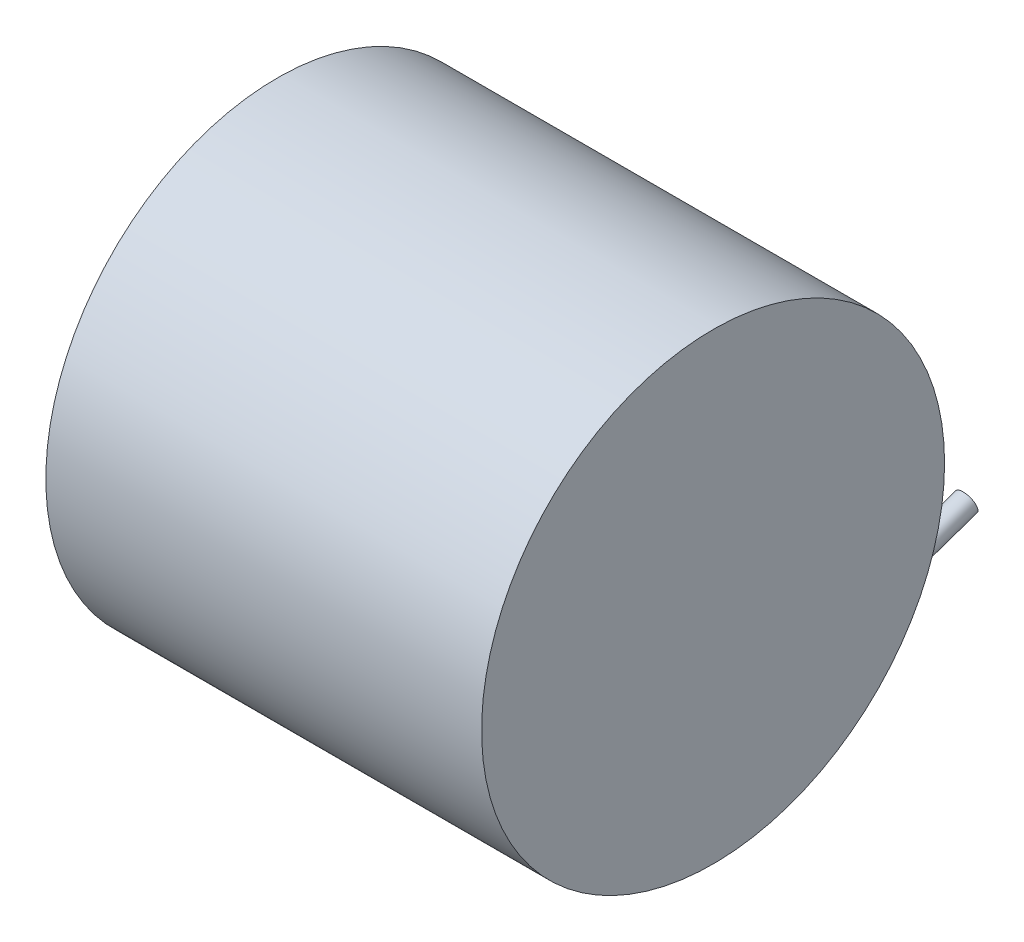
ISO-10303-21;
HEADER;
FILE_DESCRIPTION(('STEP AP214'),'2;1');
FILE_NAME('part.step','',(''),(''),'','','');
FILE_SCHEMA(('AUTOMOTIVE_DESIGN { 1 0 10303 214 1 1 1 1 }'));
ENDSEC;
DATA;
#1=APPLICATION_CONTEXT('core data for automotive mechanical design processes');
#2=APPLICATION_PROTOCOL_DEFINITION('international standard','automotive_design',2000,#1);
#3=PRODUCT_CONTEXT('',#1,'mechanical');
#4=PRODUCT('Part','Part','',(#3));
#5=PRODUCT_RELATED_PRODUCT_CATEGORY('part','',(#4));
#6=PRODUCT_DEFINITION_FORMATION('','',#4);
#7=PRODUCT_DEFINITION_CONTEXT('part definition',#1,'design');
#8=PRODUCT_DEFINITION('design','',#6,#7);
#9=PRODUCT_DEFINITION_SHAPE('','',#8);
#10=(LENGTH_UNIT() NAMED_UNIT(*) SI_UNIT(.MILLI.,.METRE.));
#11=(NAMED_UNIT(*) PLANE_ANGLE_UNIT() SI_UNIT($,.RADIAN.));
#12=(NAMED_UNIT(*) SI_UNIT($,.STERADIAN.) SOLID_ANGLE_UNIT());
#13=UNCERTAINTY_MEASURE_WITH_UNIT(LENGTH_MEASURE(1.E-05),#10,'distance_accuracy_value','');
#14=(GEOMETRIC_REPRESENTATION_CONTEXT(3) GLOBAL_UNCERTAINTY_ASSIGNED_CONTEXT((#13)) GLOBAL_UNIT_ASSIGNED_CONTEXT((#10,
#11,#12)) REPRESENTATION_CONTEXT('',''));
#15=CARTESIAN_POINT('',(0.,0.,0.));
#16=DIRECTION('',(0.,0.,1.));
#17=DIRECTION('',(1.,0.,0.));
#18=AXIS2_PLACEMENT_3D('',#15,#16,#17);
#19=CARTESIAN_POINT('',(40.,0.,0.));
#20=DIRECTION('',(-1.,0.,0.));
#21=DIRECTION('',(0.,0.,1.));
#22=AXIS2_PLACEMENT_3D('',#19,#20,#21);
#23=CYLINDRICAL_SURFACE('',#22,42.5);
#24=CARTESIAN_POINT('',(30.,-23.2735317158455,-35.5611124892281));
#25=CARTESIAN_POINT('',(29.9181638025656,-23.2735332996999,-35.5611115095006));
#26=CARTESIAN_POINT('',(29.836320622979,-23.2804706848976,-35.5565740620142));
#27=CARTESIAN_POINT('',(29.6757838431791,-23.3074507165318,-35.5388940035885));
#28=CARTESIAN_POINT('',(29.5970932933516,-23.3275057449902,-35.5257432623624));
#29=CARTESIAN_POINT('',(29.4459203923452,-23.3785563219496,-35.492168327426));
#30=CARTESIAN_POINT('',(29.3733889706694,-23.409452792315,-35.4718099881578));
#31=CARTESIAN_POINT('',(29.2348522436099,-23.4799853452545,-35.4251616760304));
#32=CARTESIAN_POINT('',(29.1688501324181,-23.5196256750695,-35.3988688203953));
#33=CARTESIAN_POINT('',(29.0116978911015,-23.6275572286709,-35.3269666422757));
#34=CARTESIAN_POINT('',(28.9248963266453,-23.7001480286348,-35.2783459223649));
#35=CARTESIAN_POINT('',(28.765904972093,-23.8552802655205,-35.1736323320623));
#36=CARTESIAN_POINT('',(28.6937534962488,-23.9378469161105,-35.1175204888983));
#37=CARTESIAN_POINT('',(28.575771652053,-24.0920868599738,-35.0118305780053));
#38=CARTESIAN_POINT('',(28.5275641957652,-24.1626268889703,-34.9631968920677));
#39=CARTESIAN_POINT('',(28.4387202200808,-24.306581269376,-34.8632727344546));
#40=CARTESIAN_POINT('',(28.398088226572,-24.3799973075387,-34.8119806978078));
#41=CARTESIAN_POINT('',(28.3236602510187,-24.5288643743967,-34.707248649177));
#42=CARTESIAN_POINT('',(28.2898728377503,-24.6043178215132,-34.6538060439352));
#43=CARTESIAN_POINT('',(28.228569738179,-24.756548941045,-34.5452173050736));
#44=CARTESIAN_POINT('',(28.2010561295553,-24.8333270431145,-34.4900706139618));
#45=CARTESIAN_POINT('',(28.1364640952319,-25.0357083856621,-34.3436622685297));
#46=CARTESIAN_POINT('',(28.1040718079943,-25.1619939048238,-34.2512604679421));
#47=CARTESIAN_POINT('',(28.0526917780445,-25.4152948471105,-34.0637295602993));
#48=CARTESIAN_POINT('',(28.0337124066324,-25.5423106762782,-33.9685987885007));
#49=CARTESIAN_POINT('',(28.0079470127825,-25.7962535236025,-33.7761561817543));
#50=CARTESIAN_POINT('',(28.0011823218178,-25.9231800001786,-33.6788408310869));
#51=CARTESIAN_POINT('',(27.9991014868595,-26.1759378572478,-33.4827696206865));
#52=CARTESIAN_POINT('',(28.0037825975655,-26.3017694930758,-33.3840141120261));
#53=CARTESIAN_POINT('',(28.0246389990105,-26.5579310348163,-33.1806320733785));
#54=CARTESIAN_POINT('',(28.041369986833,-26.6881765778196,-33.075956270627));
#55=CARTESIAN_POINT('',(28.086840240602,-26.946211635905,-32.8660819215592));
#56=CARTESIAN_POINT('',(28.1155837115705,-27.0740002745359,-32.760883204949));
#57=CARTESIAN_POINT('',(28.1854153458707,-27.3261970897215,-32.5508196265942));
#58=CARTESIAN_POINT('',(28.2264893914645,-27.4506089557791,-32.445954520915));
#59=CARTESIAN_POINT('',(28.3219444959575,-27.6952019117186,-32.2374246723439));
#60=CARTESIAN_POINT('',(28.3763150824342,-27.815386246428,-32.1337590517021));
#61=CARTESIAN_POINT('',(28.4709933022678,-27.9946738598928,-31.9774142299141));
#62=CARTESIAN_POINT('',(28.5058294382896,-28.0558374298165,-31.9237598446182));
#63=CARTESIAN_POINT('',(28.5801729172456,-28.1762331977087,-31.8175472721123));
#64=CARTESIAN_POINT('',(28.6196787636044,-28.2354660067364,-31.7649887400154));
#65=CARTESIAN_POINT('',(28.7038060356763,-28.3513832325488,-31.6615711006362));
#66=CARTESIAN_POINT('',(28.7484127417869,-28.4080743562533,-31.6107076243303));
#67=CARTESIAN_POINT('',(28.8435319491947,-28.5183606375227,-31.5112457589563));
#68=CARTESIAN_POINT('',(28.8940399067974,-28.5719581301514,-31.462645666989));
#69=CARTESIAN_POINT('',(28.9998317931792,-28.6730555136968,-31.3705336277163));
#70=CARTESIAN_POINT('',(29.0548561940853,-28.7207108959646,-31.3268977024624));
#71=CARTESIAN_POINT('',(29.1722464020568,-28.8107682706509,-31.2440932191946));
#72=CARTESIAN_POINT('',(29.2346112364622,-28.8531709575643,-31.2049240706522));
#73=CARTESIAN_POINT('',(29.3563797510383,-28.9239065473587,-31.1393570582055));
#74=CARTESIAN_POINT('',(29.4145276051771,-28.953406462314,-31.1119189850226));
#75=CARTESIAN_POINT('',(29.5365404929148,-29.0051639984892,-31.06367196612));
#76=CARTESIAN_POINT('',(29.6003933542437,-29.0274365906563,-31.0428493188573));
#77=CARTESIAN_POINT('',(29.717893556557,-29.0585201438912,-31.0137511069132));
#78=CARTESIAN_POINT('',(29.7705893193943,-29.0692352329798,-31.003703998552));
#79=CARTESIAN_POINT('',(29.8777012501331,-29.0840369989701,-30.9898192825166));
#80=CARTESIAN_POINT('',(29.9321157910455,-29.0881297635412,-30.9859759719178));
#81=CARTESIAN_POINT('',(30.041188736157,-29.0892742414534,-30.9849015694051));
#82=CARTESIAN_POINT('',(30.0958474052159,-29.0863129237056,-30.9876827149261));
#83=CARTESIAN_POINT('',(30.2036720550184,-29.0736365741358,-30.9995762542061));
#84=CARTESIAN_POINT('',(30.2568367748439,-29.0639160055721,-31.0086938383629));
#85=CARTESIAN_POINT('',(30.3737001778224,-29.0353478985425,-31.0354481121986));
#86=CARTESIAN_POINT('',(30.4366132799567,-29.0148013826415,-31.0546677177913));
#87=CARTESIAN_POINT('',(30.5570944139333,-28.966548634472,-31.0996808847172));
#88=CARTESIAN_POINT('',(30.6146511362301,-28.9388277003341,-31.1254879435991));
#89=CARTESIAN_POINT('',(30.7566065435056,-28.8602582845193,-31.198393621964));
#90=CARTESIAN_POINT('',(30.8368924578668,-28.8053942132114,-31.2490899405681));
#91=CARTESIAN_POINT('',(30.9856497127732,-28.6873418153393,-31.3575015993757));
#92=CARTESIAN_POINT('',(31.0540890131224,-28.6241317046919,-31.4152352764763));
#93=CARTESIAN_POINT('',(31.17789283595,-28.4954753479553,-31.5319688604923));
#94=CARTESIAN_POINT('',(31.2337392817649,-28.4302979508794,-31.5907619303495));
#95=CARTESIAN_POINT('',(31.3378729707834,-28.2962692564527,-31.7108697460513));
#96=CARTESIAN_POINT('',(31.3861535423699,-28.227414787573,-31.7721866579473));
#97=CARTESIAN_POINT('',(31.4761861886309,-28.0868082519237,-31.8965520094442));
#98=CARTESIAN_POINT('',(31.517925997001,-28.015051051055,-31.9596034477504));
#99=CARTESIAN_POINT('',(31.5954922300305,-27.8693063028787,-32.0867750849086));
#100=CARTESIAN_POINT('',(31.6313167176456,-27.7953180343234,-32.1508956263138));
#101=CARTESIAN_POINT('',(31.7220096557886,-27.590259857917,-32.3273412506551));
#102=CARTESIAN_POINT('',(31.7714345694681,-27.4573400003346,-32.440337096075));
#103=CARTESIAN_POINT('',(31.8556275049284,-27.1873588669018,-32.6669350460766));
#104=CARTESIAN_POINT('',(31.8903848088859,-27.0502946408055,-32.7805375327709));
#105=CARTESIAN_POINT('',(31.9458787080835,-26.7729497180552,-33.007442879301));
#106=CARTESIAN_POINT('',(31.9666050607767,-26.6326667487971,-33.1207454602374));
#107=CARTESIAN_POINT('',(31.9939790528839,-26.3498797548833,-33.3461618395572));
#108=CARTESIAN_POINT('',(32.0006332304486,-26.2073767926872,-33.4582761659199));
#109=CARTESIAN_POINT('',(31.999413382243,-25.9505955702221,-33.6576482814012));
#110=CARTESIAN_POINT('',(31.9942577390733,-25.836570911047,-33.7452543882667));
#111=CARTESIAN_POINT('',(31.9741407975783,-25.6081514793968,-33.9189203142113));
#112=CARTESIAN_POINT('',(31.9591778597308,-25.493756648221,-34.0049798722761));
#113=CARTESIAN_POINT('',(31.9186759072614,-25.265629268105,-34.1748172939492));
#114=CARTESIAN_POINT('',(31.8931671391503,-25.1518957608489,-34.2586009585378));
#115=CARTESIAN_POINT('',(31.830462314908,-24.9257706974916,-34.4234732829082));
#116=CARTESIAN_POINT('',(31.7932738216285,-24.8133783217266,-34.5045636491886));
#117=CARTESIAN_POINT('',(31.7019146802144,-24.5815967777052,-34.670117924498));
#118=CARTESIAN_POINT('',(31.6465537830469,-24.4624427996149,-34.7542673647035));
#119=CARTESIAN_POINT('',(31.5176990183391,-24.2299183771686,-34.9167737007074));
#120=CARTESIAN_POINT('',(31.4442143148755,-24.1165450447545,-34.9951334980237));
#121=CARTESIAN_POINT('',(31.2955964687515,-23.9254271333623,-35.1259746672387));
#122=CARTESIAN_POINT('',(31.2248319174303,-23.8455336296586,-35.1802330901521));
#123=CARTESIAN_POINT('',(31.0693325137068,-23.6952938479786,-35.2815985847453));
#124=CARTESIAN_POINT('',(30.9846256855521,-23.6249289242495,-35.3287196450614));
#125=CARTESIAN_POINT('',(30.82791020987,-23.5174743723011,-35.4003004880705));
#126=CARTESIAN_POINT('',(30.7596148389629,-23.476711690808,-35.4273323611213));
#127=CARTESIAN_POINT('',(30.6161054141824,-23.4046135799017,-35.4750042778411));
#128=CARTESIAN_POINT('',(30.5408978546431,-23.3732694172184,-35.4956502433329));
#129=CARTESIAN_POINT('',(30.3892426230644,-23.323863340553,-35.5281330502959));
#130=CARTESIAN_POINT('',(30.3131033959751,-23.3051527442406,-35.5404005657072));
#131=CARTESIAN_POINT('',(30.1579768538235,-23.2799906806306,-35.556887795243));
#132=CARTESIAN_POINT('',(30.0789916795153,-23.2735301870438,-35.5611134349015));
#133=CARTESIAN_POINT('',(30.,-23.2735317158455,-35.5611124892281));
#134=B_SPLINE_CURVE_WITH_KNOTS('',3,(#24,#25,#26,#27,#28,#29,#30,#31,#32,#33,#34,#35,#36,#37,
#38,#39,#40,#41,#42,#43,#44,#45,#46,#47,#48,#49,#50,#51,#52,#53,#54,#55,#56,#57,#58,#59,#60,#61,
#62,#63,#64,#65,#66,#67,#68,#69,#70,#71,#72,#73,#74,#75,#76,#77,#78,#79,#80,#81,#82,#83,#84,#85,
#86,#87,#88,#89,#90,#91,#92,#93,#94,#95,#96,#97,#98,#99,#100,#101,#102,#103,#104,#105,#106,#107,
#108,#109,#110,#111,#112,#113,#114,#115,#116,#117,#118,#119,#120,#121,#122,#123,#124,#125,#126,
#127,#128,#129,#130,#131,#132,#133),.UNSPECIFIED.,.T.,.F.,(4,2,2,2,2,2,2,2,2,2,2,2,2,2,2,2,2,2,
2,2,2,2,2,2,2,2,2,2,2,2,2,2,2,2,2,2,2,2,2,2,2,2,2,2,2,2,2,2,2,2,2,2,2,2,4),(0.,
0.245128471810414,0.490488660153122,0.733662559535494,0.976954839301785,1.34436601174388,
1.71272603423363,2.00726001851486,2.30196940934738,2.59704549931072,2.89221916737873,
3.37088165398352,3.84984262132957,4.32963923048475,4.80932077066647,5.31266849812507,
5.81619257242812,6.31914232768465,6.82169722577007,7.08709592493045,7.35240979704213,
7.61697650278043,7.88134083021939,8.13550311590623,8.3896317611085,8.60116416494381,
8.81225555320783,8.97567791025381,9.13894995336748,9.30252384467406,9.46623188323015,
9.67183026272801,9.87785333858812,10.2049975683323,10.5330132138473,10.8446657911904,
11.1565916570414,11.469095671396,11.7817018169435,12.3248854851832,12.868465380766,
13.4124416611619,13.9561651461686,14.3875147454574,14.8189364734747,15.2491293311999,
15.6790442029084,16.1461282205255,16.6129765453969,16.9711130411585,17.3285382748098,
17.5796873359319,17.8306027966975,18.0673854645998,18.3039935951382),.UNSPECIFIED.);
#135=CARTESIAN_POINT('',(30.,-23.2735317158455,-35.5611124892281));
#136=VERTEX_POINT('',#135);
#137=EDGE_CURVE('E41',#136,#136,#134,.T.);
#138=ORIENTED_EDGE('',*,*,#137,.T.);
#139=EDGE_LOOP('',(#138));
#140=FACE_BOUND('',#139,.T.);
#141=CARTESIAN_POINT('',(40.,0.,0.));
#142=DIRECTION('',(1.,0.,0.));
#143=DIRECTION('',(0.,0.,-1.));
#144=AXIS2_PLACEMENT_3D('',#141,#142,#143);
#145=CIRCLE('',#144,42.5);
#146=CARTESIAN_POINT('',(40.,0.,-42.5));
#147=VERTEX_POINT('',#146);
#148=EDGE_CURVE('E49',#147,#147,#145,.T.);
#149=ORIENTED_EDGE('',*,*,#148,.F.);
#150=EDGE_LOOP('',(#149));
#151=FACE_BOUND('',#150,.T.);
#152=CARTESIAN_POINT('',(-40.,0.,0.));
#153=DIRECTION('',(1.,0.,0.));
#154=DIRECTION('',(0.,0.,-1.));
#155=AXIS2_PLACEMENT_3D('',#152,#153,#154);
#156=CIRCLE('',#155,42.5);
#157=CARTESIAN_POINT('',(-40.,0.,-42.5));
#158=VERTEX_POINT('',#157);
#159=EDGE_CURVE('E53',#158,#158,#156,.T.);
#160=ORIENTED_EDGE('',*,*,#159,.T.);
#161=EDGE_LOOP('',(#160));
#162=FACE_BOUND('',#161,.T.);
#163=ADVANCED_FACE('F37',(#140,#151,#162),#23,.T.);
#164=CARTESIAN_POINT('',(40.,0.,0.));
#165=DIRECTION('',(1.,0.,0.));
#166=DIRECTION('',(0.,0.,-1.));
#167=AXIS2_PLACEMENT_3D('',#164,#165,#166);
#168=PLANE('',#167);
#169=ORIENTED_EDGE('',*,*,#148,.T.);
#170=EDGE_LOOP('',(#169));
#171=FACE_BOUND('',#170,.T.);
#172=ADVANCED_FACE('F85',(#171),#168,.T.);
#173=CARTESIAN_POINT('',(-40.,0.,0.));
#174=DIRECTION('',(1.,0.,0.));
#175=DIRECTION('',(0.,0.,-1.));
#176=AXIS2_PLACEMENT_3D('',#173,#174,#175);
#177=PLANE('',#176);
#178=CARTESIAN_POINT('',(-40.,5.28894340760569,-15.290703642971));
#179=DIRECTION('',(1.,0.,0.));
#180=DIRECTION('',(0.,0.,-1.));
#181=AXIS2_PLACEMENT_3D('',#178,#179,#180);
#182=CIRCLE('',#181,2.);
#183=CARTESIAN_POINT('',(-40.,5.28894340760569,-17.290703642971));
#184=VERTEX_POINT('',#183);
#185=EDGE_CURVE('E10',#184,#184,#182,.F.);
#186=ORIENTED_EDGE('',*,*,#185,.F.);
#187=EDGE_LOOP('',(#186));
#188=FACE_BOUND('',#187,.T.);
#189=ORIENTED_EDGE('',*,*,#159,.F.);
#190=EDGE_LOOP('',(#189));
#191=FACE_BOUND('',#190,.T.);
#192=ADVANCED_FACE('F89',(#188,#191),#177,.F.);
#193=CARTESIAN_POINT('',(-55.,5.28894340760569,-15.290703642971));
#194=DIRECTION('',(1.,0.,0.));
#195=DIRECTION('',(0.,0.,-1.));
#196=AXIS2_PLACEMENT_3D('',#193,#194,#195);
#197=CYLINDRICAL_SURFACE('',#196,2.);
#198=CARTESIAN_POINT('',(-55.,5.28894340760569,-15.290703642971));
#199=DIRECTION('',(-1.,0.,0.));
#200=DIRECTION('',(0.,0.,1.));
#201=AXIS2_PLACEMENT_3D('',#198,#199,#200);
#202=CIRCLE('',#201,2.);
#203=CARTESIAN_POINT('',(-55.,5.28894340760569,-13.290703642971));
#204=VERTEX_POINT('',#203);
#205=EDGE_CURVE('E57',#204,#204,#202,.T.);
#206=ORIENTED_EDGE('',*,*,#205,.F.);
#207=EDGE_LOOP('',(#206));
#208=FACE_BOUND('',#207,.T.);
#209=ORIENTED_EDGE('',*,*,#185,.T.);
#210=EDGE_LOOP('',(#209));
#211=FACE_BOUND('',#210,.T.);
#212=ADVANCED_FACE('F81',(#208,#211),#197,.T.);
#213=CARTESIAN_POINT('',(-55.,5.28894340760569,-15.290703642971));
#214=DIRECTION('',(-1.,0.,0.));
#215=DIRECTION('',(0.,0.,1.));
#216=AXIS2_PLACEMENT_3D('',#213,#214,#215);
#217=PLANE('',#216);
#218=ORIENTED_EDGE('',*,*,#205,.T.);
#219=EDGE_LOOP('',(#218));
#220=FACE_BOUND('',#219,.T.);
#221=ADVANCED_FACE('F73',(#220),#217,.T.);
#222=CARTESIAN_POINT('',(30.,-27.9420851848589,-28.1822617176493));
#223=DIRECTION('',(0.,0.326890198762986,-0.945062324903864));
#224=DIRECTION('',(0.,0.945062324903864,0.326890198762986));
#225=AXIS2_PLACEMENT_3D('',#222,#223,#224);
#226=CYLINDRICAL_SURFACE('',#225,2.);
#227=CARTESIAN_POINT('',(30.,-18.1353792219693,-56.5341314647653));
#228=DIRECTION('',(0.,0.326890198762986,-0.945062324903864));
#229=DIRECTION('',(0.,0.945062324903864,0.326890198762986));
#230=AXIS2_PLACEMENT_3D('',#227,#228,#229);
#231=CIRCLE('',#230,2.);
#232=CARTESIAN_POINT('',(30.,-16.2452545721616,-55.8803510672393));
#233=VERTEX_POINT('',#232);
#234=EDGE_CURVE('E61',#233,#233,#231,.T.);
#235=ORIENTED_EDGE('',*,*,#234,.F.);
#236=EDGE_LOOP('',(#235));
#237=FACE_BOUND('',#236,.T.);
#238=ORIENTED_EDGE('',*,*,#137,.F.);
#239=EDGE_LOOP('',(#238));
#240=FACE_BOUND('',#239,.T.);
#241=ADVANCED_FACE('F70',(#237,#240),#226,.T.);
#242=CARTESIAN_POINT('',(30.,-18.1353792219693,-56.5341314647653));
#243=DIRECTION('',(0.,0.326890198762986,-0.945062324903864));
#244=DIRECTION('',(0.,0.945062324903864,0.326890198762986));
#245=AXIS2_PLACEMENT_3D('',#242,#243,#244);
#246=PLANE('',#245);
#247=ORIENTED_EDGE('',*,*,#234,.T.);
#248=EDGE_LOOP('',(#247));
#249=FACE_BOUND('',#248,.T.);
#250=ADVANCED_FACE('F72',(#249),#246,.T.);
#251=CLOSED_SHELL('',(#163,#172,#192,#212,#221,#241,#250));
#252=MANIFOLD_SOLID_BREP('B2',#251);
#253=ADVANCED_BREP_SHAPE_REPRESENTATION('',(#18,#252),#14);
#254=SHAPE_DEFINITION_REPRESENTATION(#9,#253);
ENDSEC;
END-ISO-10303-21;
